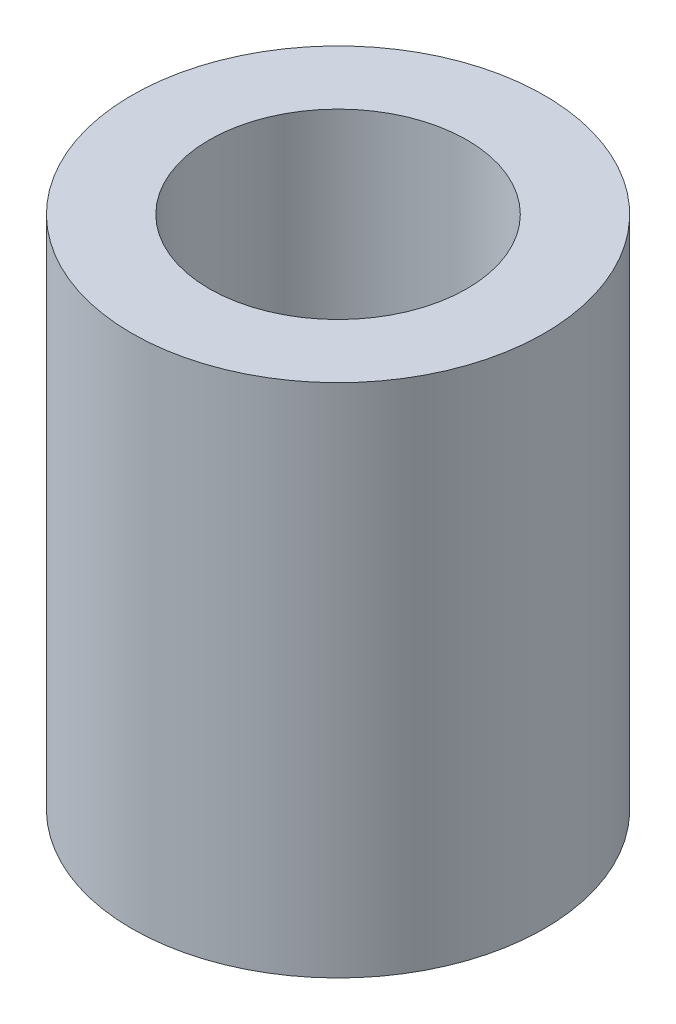
ISO-10303-21;
HEADER;
FILE_DESCRIPTION(('STEP AP214'),'2;1');
FILE_NAME('part.step','',(''),(''),'','','');
FILE_SCHEMA(('AUTOMOTIVE_DESIGN { 1 0 10303 214 1 1 1 1 }'));
ENDSEC;
DATA;
#1=APPLICATION_CONTEXT('core data for automotive mechanical design processes');
#2=APPLICATION_PROTOCOL_DEFINITION('international standard','automotive_design',2000,#1);
#3=PRODUCT_CONTEXT('',#1,'mechanical');
#4=PRODUCT('Part','Part','',(#3));
#5=PRODUCT_RELATED_PRODUCT_CATEGORY('part','',(#4));
#6=PRODUCT_DEFINITION_FORMATION('','',#4);
#7=PRODUCT_DEFINITION_CONTEXT('part definition',#1,'design');
#8=PRODUCT_DEFINITION('design','',#6,#7);
#9=PRODUCT_DEFINITION_SHAPE('','',#8);
#10=(LENGTH_UNIT() NAMED_UNIT(*) SI_UNIT(.MILLI.,.METRE.));
#11=(NAMED_UNIT(*) PLANE_ANGLE_UNIT() SI_UNIT($,.RADIAN.));
#12=(NAMED_UNIT(*) SI_UNIT($,.STERADIAN.) SOLID_ANGLE_UNIT());
#13=UNCERTAINTY_MEASURE_WITH_UNIT(LENGTH_MEASURE(1.E-05),#10,'distance_accuracy_value','');
#14=(GEOMETRIC_REPRESENTATION_CONTEXT(3) GLOBAL_UNCERTAINTY_ASSIGNED_CONTEXT((#13)) GLOBAL_UNIT_ASSIGNED_CONTEXT((#10,
#11,#12)) REPRESENTATION_CONTEXT('',''));
#15=CARTESIAN_POINT('',(0.,0.,0.));
#16=DIRECTION('',(0.,0.,1.));
#17=DIRECTION('',(1.,0.,0.));
#18=AXIS2_PLACEMENT_3D('',#15,#16,#17);
#19=CARTESIAN_POINT('',(0.,12.7,0.));
#20=DIRECTION('',(0.,-1.,0.));
#21=DIRECTION('',(0.,0.,-1.));
#22=AXIS2_PLACEMENT_3D('',#19,#20,#21);
#23=CYLINDRICAL_SURFACE('',#22,5.08);
#24=CARTESIAN_POINT('',(0.,12.7,0.));
#25=DIRECTION('',(0.,1.,0.));
#26=DIRECTION('',(0.,0.,1.));
#27=AXIS2_PLACEMENT_3D('',#24,#25,#26);
#28=CIRCLE('',#27,5.08);
#29=CARTESIAN_POINT('',(0.,12.7,5.08));
#30=VERTEX_POINT('',#29);
#31=EDGE_CURVE('E10',#30,#30,#28,.T.);
#32=ORIENTED_EDGE('',*,*,#31,.F.);
#33=EDGE_LOOP('',(#32));
#34=FACE_BOUND('',#33,.T.);
#35=CARTESIAN_POINT('',(0.,0.,0.));
#36=DIRECTION('',(0.,1.,0.));
#37=DIRECTION('',(0.,0.,1.));
#38=AXIS2_PLACEMENT_3D('',#35,#36,#37);
#39=CIRCLE('',#38,5.08);
#40=CARTESIAN_POINT('',(0.,0.,5.08));
#41=VERTEX_POINT('',#40);
#42=EDGE_CURVE('E40',#41,#41,#39,.T.);
#43=ORIENTED_EDGE('',*,*,#42,.T.);
#44=EDGE_LOOP('',(#43));
#45=FACE_BOUND('',#44,.T.);
#46=ADVANCED_FACE('F37',(#34,#45),#23,.T.);
#47=CARTESIAN_POINT('',(0.,12.7,0.));
#48=DIRECTION('',(0.,1.,0.));
#49=DIRECTION('',(0.,0.,1.));
#50=AXIS2_PLACEMENT_3D('',#47,#48,#49);
#51=PLANE('',#50);
#52=CARTESIAN_POINT('',(0.,12.7,0.));
#53=DIRECTION('',(0.,-1.,0.));
#54=DIRECTION('',(0.,0.,-1.));
#55=AXIS2_PLACEMENT_3D('',#52,#53,#54);
#56=CIRCLE('',#55,3.175);
#57=CARTESIAN_POINT('',(0.,12.7,-3.175));
#58=VERTEX_POINT('',#57);
#59=EDGE_CURVE('E49',#58,#58,#56,.T.);
#60=ORIENTED_EDGE('',*,*,#59,.T.);
#61=EDGE_LOOP('',(#60));
#62=FACE_BOUND('',#61,.T.);
#63=ORIENTED_EDGE('',*,*,#31,.T.);
#64=EDGE_LOOP('',(#63));
#65=FACE_BOUND('',#64,.T.);
#66=ADVANCED_FACE('F59',(#62,#65),#51,.T.);
#67=CARTESIAN_POINT('',(0.,0.,0.));
#68=DIRECTION('',(0.,1.,0.));
#69=DIRECTION('',(0.,0.,1.));
#70=AXIS2_PLACEMENT_3D('',#67,#68,#69);
#71=PLANE('',#70);
#72=CARTESIAN_POINT('',(0.,0.,0.));
#73=DIRECTION('',(0.,-1.,0.));
#74=DIRECTION('',(0.,0.,-1.));
#75=AXIS2_PLACEMENT_3D('',#72,#73,#74);
#76=CIRCLE('',#75,3.175);
#77=CARTESIAN_POINT('',(0.,0.,-3.175));
#78=VERTEX_POINT('',#77);
#79=EDGE_CURVE('E51',#78,#78,#76,.T.);
#80=ORIENTED_EDGE('',*,*,#79,.F.);
#81=EDGE_LOOP('',(#80));
#82=FACE_BOUND('',#81,.T.);
#83=ORIENTED_EDGE('',*,*,#42,.F.);
#84=EDGE_LOOP('',(#83));
#85=FACE_BOUND('',#84,.T.);
#86=ADVANCED_FACE('F64',(#82,#85),#71,.F.);
#87=CARTESIAN_POINT('',(0.,12.7,0.));
#88=DIRECTION('',(0.,-1.,0.));
#89=DIRECTION('',(0.,0.,-1.));
#90=AXIS2_PLACEMENT_3D('',#87,#88,#89);
#91=CYLINDRICAL_SURFACE('',#90,3.175);
#92=ORIENTED_EDGE('',*,*,#59,.F.);
#93=EDGE_LOOP('',(#92));
#94=FACE_BOUND('',#93,.T.);
#95=ORIENTED_EDGE('',*,*,#79,.T.);
#96=EDGE_LOOP('',(#95));
#97=FACE_BOUND('',#96,.T.);
#98=ADVANCED_FACE('F61',(#94,#97),#91,.F.);
#99=CLOSED_SHELL('',(#46,#66,#86,#98));
#100=MANIFOLD_SOLID_BREP('B2',#99);
#101=ADVANCED_BREP_SHAPE_REPRESENTATION('',(#18,#100),#14);
#102=SHAPE_DEFINITION_REPRESENTATION(#9,#101);
ENDSEC;
END-ISO-10303-21;
